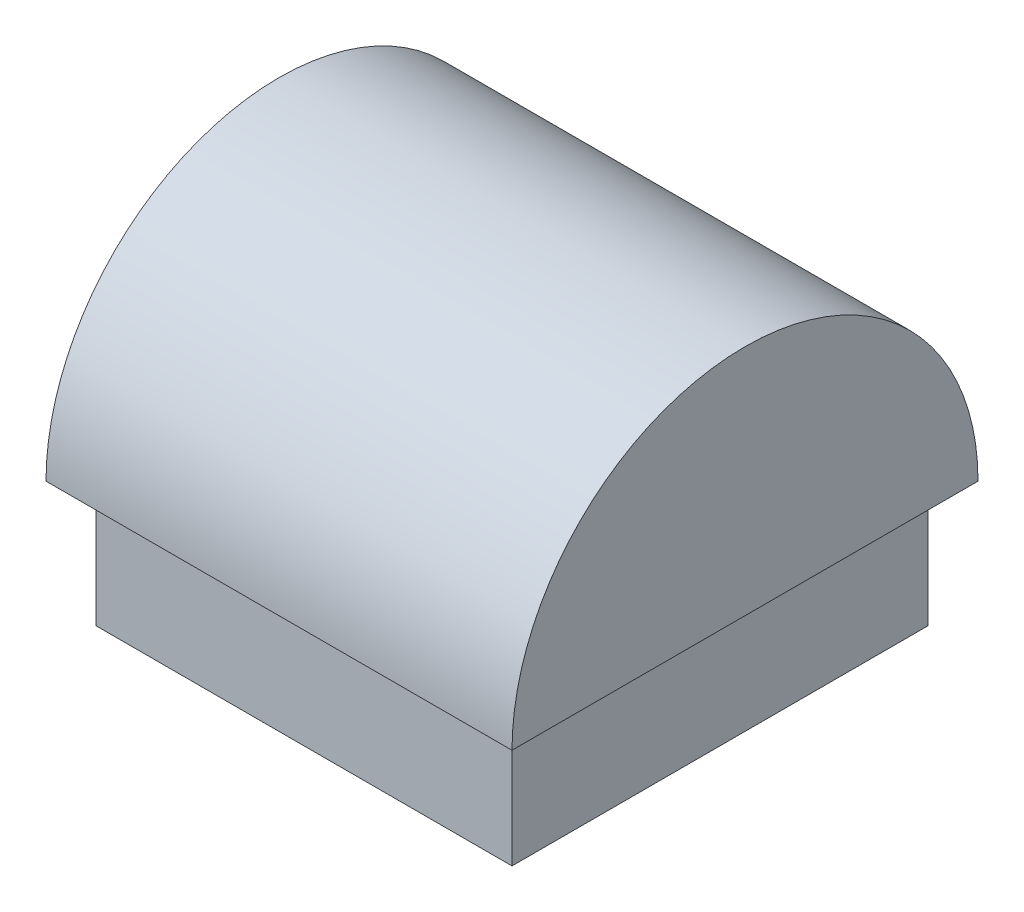
ISO-10303-21;
HEADER;
FILE_DESCRIPTION(('STEP AP214'),'2;1');
FILE_NAME('part.step','',(''),(''),'','','');
FILE_SCHEMA(('AUTOMOTIVE_DESIGN { 1 0 10303 214 1 1 1 1 }'));
ENDSEC;
DATA;
#1=APPLICATION_CONTEXT('core data for automotive mechanical design processes');
#2=APPLICATION_PROTOCOL_DEFINITION('international standard','automotive_design',2000,#1);
#3=PRODUCT_CONTEXT('',#1,'mechanical');
#4=PRODUCT('Part','Part','',(#3));
#5=PRODUCT_RELATED_PRODUCT_CATEGORY('part','',(#4));
#6=PRODUCT_DEFINITION_FORMATION('','',#4);
#7=PRODUCT_DEFINITION_CONTEXT('part definition',#1,'design');
#8=PRODUCT_DEFINITION('design','',#6,#7);
#9=PRODUCT_DEFINITION_SHAPE('','',#8);
#10=(LENGTH_UNIT() NAMED_UNIT(*) SI_UNIT(.MILLI.,.METRE.));
#11=(NAMED_UNIT(*) PLANE_ANGLE_UNIT() SI_UNIT($,.RADIAN.));
#12=(NAMED_UNIT(*) SI_UNIT($,.STERADIAN.) SOLID_ANGLE_UNIT());
#13=UNCERTAINTY_MEASURE_WITH_UNIT(LENGTH_MEASURE(1.E-05),#10,'distance_accuracy_value','');
#14=(GEOMETRIC_REPRESENTATION_CONTEXT(3) GLOBAL_UNCERTAINTY_ASSIGNED_CONTEXT((#13)) GLOBAL_UNIT_ASSIGNED_CONTEXT((#10,
#11,#12)) REPRESENTATION_CONTEXT('',''));
#15=CARTESIAN_POINT('',(0.,0.,0.));
#16=DIRECTION('',(0.,0.,1.));
#17=DIRECTION('',(1.,0.,0.));
#18=AXIS2_PLACEMENT_3D('',#15,#16,#17);
#19=CARTESIAN_POINT('',(10.75182,6.30752622594324,10.75182));
#20=DIRECTION('',(-1.,0.,0.));
#21=DIRECTION('',(0.,0.,1.));
#22=AXIS2_PLACEMENT_3D('',#19,#20,#21);
#23=PLANE('',#22);
#24=DIRECTION('',(0.,0.,-1.));
#25=VECTOR('',#24,1.);
#26=CARTESIAN_POINT('',(10.75182,-0.169473774056755,10.75182));
#27=LINE('',#26,#25);
#28=CARTESIAN_POINT('',(10.75182,-0.169473774056755,10.75182));
#29=VERTEX_POINT('',#28);
#30=CARTESIAN_POINT('',(10.75182,-0.169473774056755,-10.75182));
#31=VERTEX_POINT('',#30);
#32=EDGE_CURVE('E117',#29,#31,#27,.T.);
#33=ORIENTED_EDGE('',*,*,#32,.T.);
#34=DIRECTION('',(0.,-1.,0.));
#35=VECTOR('',#34,1.);
#36=CARTESIAN_POINT('',(10.75182,6.30752622594324,-10.75182));
#37=LINE('',#36,#35);
#38=CARTESIAN_POINT('',(10.75182,6.30752622594324,-10.75182));
#39=VERTEX_POINT('',#38);
#40=EDGE_CURVE('E11',#39,#31,#37,.T.);
#41=ORIENTED_EDGE('',*,*,#40,.F.);
#42=DIRECTION('',(0.,0.,-1.));
#43=VECTOR('',#42,1.);
#44=CARTESIAN_POINT('',(10.75182,6.30752622594324,10.75182));
#45=LINE('',#44,#43);
#46=CARTESIAN_POINT('',(10.75182,6.30752622594324,10.75182));
#47=VERTEX_POINT('',#46);
#48=EDGE_CURVE('E125',#47,#39,#45,.T.);
#49=ORIENTED_EDGE('',*,*,#48,.F.);
#50=DIRECTION('',(0.,-1.,0.));
#51=VECTOR('',#50,1.);
#52=CARTESIAN_POINT('',(10.75182,6.30752622594324,10.75182));
#53=LINE('',#52,#51);
#54=EDGE_CURVE('E134',#47,#29,#53,.T.);
#55=ORIENTED_EDGE('',*,*,#54,.T.);
#56=EDGE_LOOP('',(#33,#41,#49,#55));
#57=FACE_BOUND('',#56,.T.);
#58=ADVANCED_FACE('F36',(#57),#23,.F.);
#59=CARTESIAN_POINT('',(-10.75182,6.30752622594324,-10.75182));
#60=DIRECTION('',(0.,0.,1.));
#61=DIRECTION('',(1.,0.,0.));
#62=AXIS2_PLACEMENT_3D('',#59,#60,#61);
#63=PLANE('',#62);
#64=DIRECTION('',(-1.,0.,0.));
#65=VECTOR('',#64,1.);
#66=CARTESIAN_POINT('',(-10.75182,-0.169473774056755,-10.75182));
#67=LINE('',#66,#65);
#68=CARTESIAN_POINT('',(-10.75182,-0.169473774056755,-10.75182));
#69=VERTEX_POINT('',#68);
#70=EDGE_CURVE('E120',#31,#69,#67,.T.);
#71=ORIENTED_EDGE('',*,*,#70,.T.);
#72=DIRECTION('',(0.,-1.,0.));
#73=VECTOR('',#72,1.);
#74=CARTESIAN_POINT('',(-10.75182,6.30752622594324,-10.75182));
#75=LINE('',#74,#73);
#76=CARTESIAN_POINT('',(-10.75182,6.30752622594324,-10.75182));
#77=VERTEX_POINT('',#76);
#78=EDGE_CURVE('E44',#77,#69,#75,.T.);
#79=ORIENTED_EDGE('',*,*,#78,.F.);
#80=DIRECTION('',(-1.,0.,0.));
#81=VECTOR('',#80,1.);
#82=CARTESIAN_POINT('',(-10.75182,6.30752622594324,-10.75182));
#83=LINE('',#82,#81);
#84=EDGE_CURVE('E78',#39,#77,#83,.T.);
#85=ORIENTED_EDGE('',*,*,#84,.F.);
#86=ORIENTED_EDGE('',*,*,#40,.T.);
#87=EDGE_LOOP('',(#71,#79,#85,#86));
#88=FACE_BOUND('',#87,.T.);
#89=ADVANCED_FACE('F156',(#88),#63,.F.);
#90=CARTESIAN_POINT('',(-10.75182,6.30752622594324,10.75182));
#91=DIRECTION('',(1.,0.,0.));
#92=DIRECTION('',(0.,0.,-1.));
#93=AXIS2_PLACEMENT_3D('',#90,#91,#92);
#94=PLANE('',#93);
#95=DIRECTION('',(0.,0.,1.));
#96=VECTOR('',#95,1.);
#97=CARTESIAN_POINT('',(-10.75182,-0.169473774056755,10.75182));
#98=LINE('',#97,#96);
#99=CARTESIAN_POINT('',(-10.75182,-0.169473774056755,10.75182));
#100=VERTEX_POINT('',#99);
#101=EDGE_CURVE('E68',#69,#100,#98,.T.);
#102=ORIENTED_EDGE('',*,*,#101,.T.);
#103=DIRECTION('',(0.,-1.,0.));
#104=VECTOR('',#103,1.);
#105=CARTESIAN_POINT('',(-10.75182,6.30752622594324,10.75182));
#106=LINE('',#105,#104);
#107=CARTESIAN_POINT('',(-10.75182,6.30752622594324,10.75182));
#108=VERTEX_POINT('',#107);
#109=EDGE_CURVE('E52',#108,#100,#106,.T.);
#110=ORIENTED_EDGE('',*,*,#109,.F.);
#111=DIRECTION('',(0.,0.,1.));
#112=VECTOR('',#111,1.);
#113=CARTESIAN_POINT('',(-10.75182,6.30752622594324,10.75182));
#114=LINE('',#113,#112);
#115=EDGE_CURVE('E129',#77,#108,#114,.T.);
#116=ORIENTED_EDGE('',*,*,#115,.F.);
#117=ORIENTED_EDGE('',*,*,#78,.T.);
#118=EDGE_LOOP('',(#102,#110,#116,#117));
#119=FACE_BOUND('',#118,.T.);
#120=ADVANCED_FACE('F140',(#119),#94,.F.);
#121=CARTESIAN_POINT('',(-10.75182,6.30752622594324,10.75182));
#122=DIRECTION('',(0.,0.,-1.));
#123=DIRECTION('',(-1.,0.,0.));
#124=AXIS2_PLACEMENT_3D('',#121,#122,#123);
#125=PLANE('',#124);
#126=DIRECTION('',(1.,0.,0.));
#127=VECTOR('',#126,1.);
#128=CARTESIAN_POINT('',(-10.75182,-0.169473774056755,10.75182));
#129=LINE('',#128,#127);
#130=EDGE_CURVE('E73',#100,#29,#129,.T.);
#131=ORIENTED_EDGE('',*,*,#130,.T.);
#132=ORIENTED_EDGE('',*,*,#54,.F.);
#133=DIRECTION('',(1.,0.,0.));
#134=VECTOR('',#133,1.);
#135=CARTESIAN_POINT('',(-10.75182,6.30752622594324,10.75182));
#136=LINE('',#135,#134);
#137=EDGE_CURVE('E132',#108,#47,#136,.T.);
#138=ORIENTED_EDGE('',*,*,#137,.F.);
#139=ORIENTED_EDGE('',*,*,#109,.T.);
#140=EDGE_LOOP('',(#131,#132,#138,#139));
#141=FACE_BOUND('',#140,.T.);
#142=ADVANCED_FACE('F145',(#141),#125,.F.);
#143=CARTESIAN_POINT('',(0.,-0.169473774056755,0.));
#144=DIRECTION('',(0.,-1.,0.));
#145=DIRECTION('',(0.,0.,-1.));
#146=AXIS2_PLACEMENT_3D('',#143,#144,#145);
#147=PLANE('',#146);
#148=ORIENTED_EDGE('',*,*,#32,.F.);
#149=ORIENTED_EDGE('',*,*,#130,.F.);
#150=ORIENTED_EDGE('',*,*,#101,.F.);
#151=ORIENTED_EDGE('',*,*,#70,.F.);
#152=EDGE_LOOP('',(#148,#149,#150,#151));
#153=FACE_BOUND('',#152,.T.);
#154=ADVANCED_FACE('F143',(#153),#147,.T.);
#155=CARTESIAN_POINT('',(12.04722,6.30752622594324,12.04722));
#156=DIRECTION('',(0.,1.,0.));
#157=DIRECTION('',(0.,0.,1.));
#158=AXIS2_PLACEMENT_3D('',#155,#156,#157);
#159=PLANE('',#158);
#160=DIRECTION('',(0.,0.,-1.));
#161=VECTOR('',#160,1.);
#162=CARTESIAN_POINT('',(-12.04722,6.30752622594324,12.04722));
#163=LINE('',#162,#161);
#164=CARTESIAN_POINT('',(-12.04722,6.30752622594324,12.04722));
#165=VERTEX_POINT('',#164);
#166=CARTESIAN_POINT('',(-12.04722,6.30752622594324,-12.04722));
#167=VERTEX_POINT('',#166);
#168=EDGE_CURVE('E112',#165,#167,#163,.T.);
#169=ORIENTED_EDGE('',*,*,#168,.T.);
#170=DIRECTION('',(-1.,0.,0.));
#171=VECTOR('',#170,1.);
#172=CARTESIAN_POINT('',(12.04722,6.30752622594324,-12.04722));
#173=LINE('',#172,#171);
#174=CARTESIAN_POINT('',(12.04722,6.30752622594324,-12.04722));
#175=VERTEX_POINT('',#174);
#176=EDGE_CURVE('E105',#175,#167,#173,.T.);
#177=ORIENTED_EDGE('',*,*,#176,.F.);
#178=DIRECTION('',(0.,0.,-1.));
#179=VECTOR('',#178,1.);
#180=CARTESIAN_POINT('',(12.04722,6.30752622594324,12.04722));
#181=LINE('',#180,#179);
#182=CARTESIAN_POINT('',(12.04722,6.30752622594324,12.04722));
#183=VERTEX_POINT('',#182);
#184=EDGE_CURVE('E97',#183,#175,#181,.T.);
#185=ORIENTED_EDGE('',*,*,#184,.F.);
#186=DIRECTION('',(-1.,0.,0.));
#187=VECTOR('',#186,1.);
#188=CARTESIAN_POINT('',(12.04722,6.30752622594324,12.04722));
#189=LINE('',#188,#187);
#190=EDGE_CURVE('E102',#183,#165,#189,.T.);
#191=ORIENTED_EDGE('',*,*,#190,.T.);
#192=EDGE_LOOP('',(#169,#177,#185,#191));
#193=FACE_BOUND('',#192,.T.);
#194=ORIENTED_EDGE('',*,*,#137,.T.);
#195=ORIENTED_EDGE('',*,*,#48,.T.);
#196=ORIENTED_EDGE('',*,*,#84,.T.);
#197=ORIENTED_EDGE('',*,*,#115,.T.);
#198=EDGE_LOOP('',(#194,#195,#196,#197));
#199=FACE_BOUND('',#198,.T.);
#200=ADVANCED_FACE('F99',(#193,#199),#159,.F.);
#201=CARTESIAN_POINT('',(12.04722,6.30752622594324,0.));
#202=DIRECTION('',(-1.,0.,0.));
#203=DIRECTION('',(0.,0.,1.));
#204=AXIS2_PLACEMENT_3D('',#201,#202,#203);
#205=CYLINDRICAL_SURFACE('',#204,12.04722);
#206=CARTESIAN_POINT('',(-12.04722,6.30752622594324,0.));
#207=DIRECTION('',(1.,0.,0.));
#208=DIRECTION('',(0.,0.,-1.));
#209=AXIS2_PLACEMENT_3D('',#206,#207,#208);
#210=CIRCLE('',#209,12.04722);
#211=EDGE_CURVE('E116',#167,#165,#210,.T.);
#212=ORIENTED_EDGE('',*,*,#211,.T.);
#213=ORIENTED_EDGE('',*,*,#190,.F.);
#214=CARTESIAN_POINT('',(12.04722,6.30752622594324,0.));
#215=DIRECTION('',(1.,0.,0.));
#216=DIRECTION('',(0.,0.,-1.));
#217=AXIS2_PLACEMENT_3D('',#214,#215,#216);
#218=CIRCLE('',#217,12.04722);
#219=EDGE_CURVE('E108',#175,#183,#218,.T.);
#220=ORIENTED_EDGE('',*,*,#219,.F.);
#221=ORIENTED_EDGE('',*,*,#176,.T.);
#222=EDGE_LOOP('',(#212,#213,#220,#221));
#223=FACE_BOUND('',#222,.T.);
#224=ADVANCED_FACE('F114',(#223),#205,.T.);
#225=CARTESIAN_POINT('',(12.04722,6.30752622594324,0.));
#226=DIRECTION('',(1.,0.,0.));
#227=DIRECTION('',(0.,0.,-1.));
#228=AXIS2_PLACEMENT_3D('',#225,#226,#227);
#229=PLANE('',#228);
#230=ORIENTED_EDGE('',*,*,#219,.T.);
#231=ORIENTED_EDGE('',*,*,#184,.T.);
#232=EDGE_LOOP('',(#230,#231));
#233=FACE_BOUND('',#232,.T.);
#234=ADVANCED_FACE('F110',(#233),#229,.T.);
#235=CARTESIAN_POINT('',(-12.04722,6.30752622594324,0.));
#236=DIRECTION('',(1.,0.,0.));
#237=DIRECTION('',(0.,0.,-1.));
#238=AXIS2_PLACEMENT_3D('',#235,#236,#237);
#239=PLANE('',#238);
#240=ORIENTED_EDGE('',*,*,#211,.F.);
#241=ORIENTED_EDGE('',*,*,#168,.F.);
#242=EDGE_LOOP('',(#240,#241));
#243=FACE_BOUND('',#242,.T.);
#244=ADVANCED_FACE('F193',(#243),#239,.F.);
#245=CLOSED_SHELL('',(#58,#89,#120,#142,#154,#200,#224,#234,#244));
#246=MANIFOLD_SOLID_BREP('B2',#245);
#247=ADVANCED_BREP_SHAPE_REPRESENTATION('',(#18,#246),#14);
#248=SHAPE_DEFINITION_REPRESENTATION(#9,#247);
ENDSEC;
END-ISO-10303-21;
